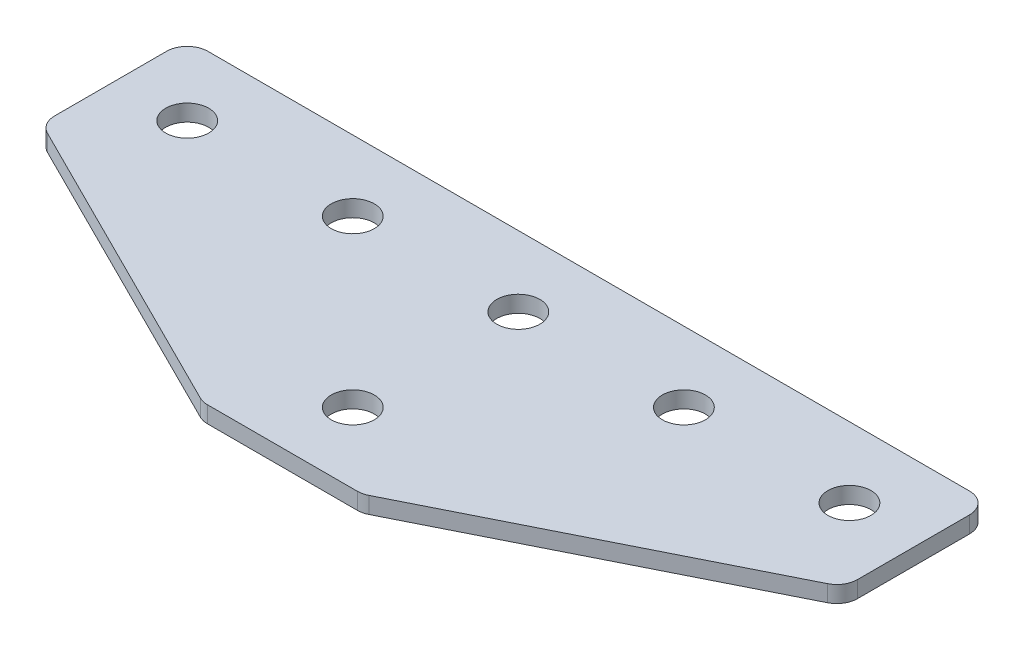
ISO-10303-21;
HEADER;
FILE_DESCRIPTION(('STEP AP214'),'2;1');
FILE_NAME('part.step','',(''),(''),'','','');
FILE_SCHEMA(('AUTOMOTIVE_DESIGN { 1 0 10303 214 1 1 1 1 }'));
ENDSEC;
DATA;
#1=APPLICATION_CONTEXT('core data for automotive mechanical design processes');
#2=APPLICATION_PROTOCOL_DEFINITION('international standard','automotive_design',2000,#1);
#3=PRODUCT_CONTEXT('',#1,'mechanical');
#4=PRODUCT('Part','Part','',(#3));
#5=PRODUCT_RELATED_PRODUCT_CATEGORY('part','',(#4));
#6=PRODUCT_DEFINITION_FORMATION('','',#4);
#7=PRODUCT_DEFINITION_CONTEXT('part definition',#1,'design');
#8=PRODUCT_DEFINITION('design','',#6,#7);
#9=PRODUCT_DEFINITION_SHAPE('','',#8);
#10=(LENGTH_UNIT() NAMED_UNIT(*) SI_UNIT(.MILLI.,.METRE.));
#11=(NAMED_UNIT(*) PLANE_ANGLE_UNIT() SI_UNIT($,.RADIAN.));
#12=(NAMED_UNIT(*) SI_UNIT($,.STERADIAN.) SOLID_ANGLE_UNIT());
#13=UNCERTAINTY_MEASURE_WITH_UNIT(LENGTH_MEASURE(1.E-05),#10,'distance_accuracy_value','');
#14=(GEOMETRIC_REPRESENTATION_CONTEXT(3) GLOBAL_UNCERTAINTY_ASSIGNED_CONTEXT((#13)) GLOBAL_UNIT_ASSIGNED_CONTEXT((#10,
#11,#12)) REPRESENTATION_CONTEXT('',''));
#15=CARTESIAN_POINT('',(0.,0.,0.));
#16=DIRECTION('',(0.,0.,1.));
#17=DIRECTION('',(1.,0.,0.));
#18=AXIS2_PLACEMENT_3D('',#15,#16,#17);
#19=CARTESIAN_POINT('',(-1.40320898344726,2.35790424423976,-11.9541495515227));
#20=DIRECTION('',(0.,-1.,0.));
#21=DIRECTION('',(0.,0.,-1.));
#22=AXIS2_PLACEMENT_3D('',#19,#20,#21);
#23=PLANE('',#22);
#24=CARTESIAN_POINT('',(-1.40320898344726,2.35790424423976,-11.9541495515227));
#25=DIRECTION('',(0.,1.,0.));
#26=DIRECTION('',(0.,0.,1.));
#27=AXIS2_PLACEMENT_3D('',#24,#25,#26);
#28=CIRCLE('',#27,2.6);
#29=CARTESIAN_POINT('',(-1.40320898344726,2.35790424423976,-9.3541495515227));
#30=VERTEX_POINT('',#29);
#31=EDGE_CURVE('E159',#30,#30,#28,.T.);
#32=ORIENTED_EDGE('',*,*,#31,.T.);
#33=EDGE_LOOP('',(#32));
#34=FACE_BOUND('',#33,.T.);
#35=DIRECTION('',(1.,0.,0.));
#36=VECTOR('',#35,1.);
#37=CARTESIAN_POINT('',(-9.90320898344732,2.35790424423976,16.5458504484773));
#38=LINE('',#37,#36);
#39=CARTESIAN_POINT('',(-10.4589370734482,2.35790424423976,16.5458504484773));
#40=VERTEX_POINT('',#39);
#41=CARTESIAN_POINT('',(7.65251910655364,2.35790424423976,16.5458504484773));
#42=VERTEX_POINT('',#41);
#43=EDGE_CURVE('E168',#40,#42,#38,.T.);
#44=ORIENTED_EDGE('',*,*,#43,.F.);
#45=CARTESIAN_POINT('',(-10.4589370734482,2.35790424423976,14.0458504484773));
#46=DIRECTION('',(0.,-1.,0.));
#47=DIRECTION('',(0.,0.,-1.));
#48=AXIS2_PLACEMENT_3D('',#45,#46,#47);
#49=CIRCLE('',#48,2.5);
#50=CARTESIAN_POINT('',(-11.5769710621981,2.35790424423976,16.2819184259771));
#51=VERTEX_POINT('',#50);
#52=EDGE_CURVE('E212',#40,#51,#49,.T.);
#53=ORIENTED_EDGE('',*,*,#52,.T.);
#54=DIRECTION('',(-0.894427190999916,0.,-0.447213595499958));
#55=VECTOR('',#54,1.);
#56=CARTESIAN_POINT('',(-11.0491070171976,2.35790424423976,16.5458504484773));
#57=LINE('',#56,#55);
#58=CARTESIAN_POINT('',(-48.5212429721971,2.35790424423976,-2.19021752902243));
#59=VERTEX_POINT('',#58);
#60=EDGE_CURVE('E132',#51,#59,#57,.T.);
#61=ORIENTED_EDGE('',*,*,#60,.T.);
#62=CARTESIAN_POINT('',(-47.4032089834472,2.35790424423976,-4.42628550652223));
#63=DIRECTION('',(0.,-1.,0.));
#64=DIRECTION('',(0.,0.,-1.));
#65=AXIS2_PLACEMENT_3D('',#62,#63,#64);
#66=CIRCLE('',#65,2.5);
#67=CARTESIAN_POINT('',(-49.9032089834472,2.35790424423976,-4.42628550652223));
#68=VERTEX_POINT('',#67);
#69=EDGE_CURVE('E186',#59,#68,#66,.T.);
#70=ORIENTED_EDGE('',*,*,#69,.T.);
#71=DIRECTION('',(0.,0.,-1.));
#72=VECTOR('',#71,1.);
#73=CARTESIAN_POINT('',(-49.9032089834472,2.35790424423976,-2.88120053464749));
#74=LINE('',#73,#72);
#75=CARTESIAN_POINT('',(-49.9032089834472,2.35790424423976,-17.9541495515227));
#76=VERTEX_POINT('',#75);
#77=EDGE_CURVE('E125',#68,#76,#74,.T.);
#78=ORIENTED_EDGE('',*,*,#77,.T.);
#79=CARTESIAN_POINT('',(-47.4032089834472,2.35790424423976,-17.9541495515227));
#80=DIRECTION('',(0.,-1.,0.));
#81=DIRECTION('',(0.,0.,-1.));
#82=AXIS2_PLACEMENT_3D('',#79,#80,#81);
#83=CIRCLE('',#82,2.5);
#84=CARTESIAN_POINT('',(-47.4032089834472,2.35790424423976,-20.4541495515227));
#85=VERTEX_POINT('',#84);
#86=EDGE_CURVE('E205',#76,#85,#83,.T.);
#87=ORIENTED_EDGE('',*,*,#86,.T.);
#88=DIRECTION('',(-1.,0.,0.));
#89=VECTOR('',#88,1.);
#90=CARTESIAN_POINT('',(47.0967910165527,2.35790424423976,-20.4541495515227));
#91=LINE('',#90,#89);
#92=CARTESIAN_POINT('',(44.5967910165527,2.35790424423976,-20.4541495515227));
#93=VERTEX_POINT('',#92);
#94=EDGE_CURVE('E165',#93,#85,#91,.T.);
#95=ORIENTED_EDGE('',*,*,#94,.F.);
#96=CARTESIAN_POINT('',(44.5967910165527,2.35790424423976,-17.9541495515227));
#97=DIRECTION('',(0.,-1.,0.));
#98=DIRECTION('',(0.,0.,-1.));
#99=AXIS2_PLACEMENT_3D('',#96,#97,#98);
#100=CIRCLE('',#99,2.5);
#101=CARTESIAN_POINT('',(47.0967910165527,2.35790424423976,-17.9541495515227));
#102=VERTEX_POINT('',#101);
#103=EDGE_CURVE('E207',#93,#102,#100,.T.);
#104=ORIENTED_EDGE('',*,*,#103,.T.);
#105=DIRECTION('',(0.,0.,-1.));
#106=VECTOR('',#105,1.);
#107=CARTESIAN_POINT('',(47.0967910165527,2.35790424423976,-2.8812005346475));
#108=LINE('',#107,#106);
#109=CARTESIAN_POINT('',(47.0967910165527,2.35790424423976,-4.42628550652224));
#110=VERTEX_POINT('',#109);
#111=EDGE_CURVE('E126',#110,#102,#108,.T.);
#112=ORIENTED_EDGE('',*,*,#111,.F.);
#113=CARTESIAN_POINT('',(44.5967910165527,2.35790424423976,-4.42628550652224));
#114=DIRECTION('',(0.,-1.,0.));
#115=DIRECTION('',(0.,0.,-1.));
#116=AXIS2_PLACEMENT_3D('',#113,#114,#115);
#117=CIRCLE('',#116,2.5);
#118=CARTESIAN_POINT('',(45.7148250053026,2.35790424423976,-2.19021752902245));
#119=VERTEX_POINT('',#118);
#120=EDGE_CURVE('E31',#110,#119,#117,.T.);
#121=ORIENTED_EDGE('',*,*,#120,.T.);
#122=DIRECTION('',(0.894427190999916,0.,-0.447213595499958));
#123=VECTOR('',#122,1.);
#124=CARTESIAN_POINT('',(8.24268905030312,2.35790424423976,16.5458504484773));
#125=LINE('',#124,#123);
#126=CARTESIAN_POINT('',(8.77055309530354,2.35790424423976,16.2819184259771));
#127=VERTEX_POINT('',#126);
#128=EDGE_CURVE('E172',#127,#119,#125,.T.);
#129=ORIENTED_EDGE('',*,*,#128,.F.);
#130=CARTESIAN_POINT('',(7.65251910655364,2.35790424423976,14.0458504484773));
#131=DIRECTION('',(0.,-1.,0.));
#132=DIRECTION('',(0.,0.,-1.));
#133=AXIS2_PLACEMENT_3D('',#130,#131,#132);
#134=CIRCLE('',#133,2.5);
#135=EDGE_CURVE('E210',#127,#42,#134,.T.);
#136=ORIENTED_EDGE('',*,*,#135,.T.);
#137=EDGE_LOOP('',(#44,#53,#61,#70,#78,#87,#95,#104,#112,#121,#129,#136));
#138=FACE_BOUND('',#137,.T.);
#139=CARTESIAN_POINT('',(-1.40320898344727,2.35790424423976,8.04585044847731));
#140=DIRECTION('',(0.,1.,0.));
#141=DIRECTION('',(0.,0.,1.));
#142=AXIS2_PLACEMENT_3D('',#139,#140,#141);
#143=CIRCLE('',#142,2.6);
#144=CARTESIAN_POINT('',(-1.40320898344727,2.35790424423976,10.6458504484773));
#145=VERTEX_POINT('',#144);
#146=EDGE_CURVE('E147',#145,#145,#143,.T.);
#147=ORIENTED_EDGE('',*,*,#146,.T.);
#148=EDGE_LOOP('',(#147));
#149=FACE_BOUND('',#148,.T.);
#150=CARTESIAN_POINT('',(38.5967910165527,2.35790424423976,-11.9541495515227));
#151=DIRECTION('',(0.,1.,0.));
#152=DIRECTION('',(0.,0.,1.));
#153=AXIS2_PLACEMENT_3D('',#150,#151,#152);
#154=CIRCLE('',#153,2.6);
#155=CARTESIAN_POINT('',(38.5967910165527,2.35790424423976,-9.3541495515227));
#156=VERTEX_POINT('',#155);
#157=EDGE_CURVE('E140',#156,#156,#154,.T.);
#158=ORIENTED_EDGE('',*,*,#157,.T.);
#159=EDGE_LOOP('',(#158));
#160=FACE_BOUND('',#159,.T.);
#161=CARTESIAN_POINT('',(18.5967910165527,2.35790424423976,-11.9541495515227));
#162=DIRECTION('',(0.,1.,0.));
#163=DIRECTION('',(0.,0.,1.));
#164=AXIS2_PLACEMENT_3D('',#161,#162,#163);
#165=CIRCLE('',#164,2.6);
#166=CARTESIAN_POINT('',(18.5967910165527,2.35790424423976,-9.35414955152269));
#167=VERTEX_POINT('',#166);
#168=EDGE_CURVE('E153',#167,#167,#165,.T.);
#169=ORIENTED_EDGE('',*,*,#168,.T.);
#170=EDGE_LOOP('',(#169));
#171=FACE_BOUND('',#170,.T.);
#172=CARTESIAN_POINT('',(-41.4032089834473,2.35790424423976,-11.9541495515227));
#173=DIRECTION('',(0.,-1.,0.));
#174=DIRECTION('',(0.,0.,1.));
#175=AXIS2_PLACEMENT_3D('',#172,#173,#174);
#176=CIRCLE('',#175,2.6);
#177=CARTESIAN_POINT('',(-41.4032089834473,2.35790424423976,-9.35414955152269));
#178=VERTEX_POINT('',#177);
#179=EDGE_CURVE('E460',#178,#178,#176,.T.);
#180=ORIENTED_EDGE('',*,*,#179,.F.);
#181=EDGE_LOOP('',(#180));
#182=FACE_BOUND('',#181,.T.);
#183=CARTESIAN_POINT('',(-21.4032089834473,2.35790424423976,-11.9541495515227));
#184=DIRECTION('',(0.,-1.,0.));
#185=DIRECTION('',(0.,0.,1.));
#186=AXIS2_PLACEMENT_3D('',#183,#184,#185);
#187=CIRCLE('',#186,2.6);
#188=CARTESIAN_POINT('',(-21.4032089834473,2.35790424423976,-9.35414955152268));
#189=VERTEX_POINT('',#188);
#190=EDGE_CURVE('E136',#189,#189,#187,.T.);
#191=ORIENTED_EDGE('',*,*,#190,.F.);
#192=EDGE_LOOP('',(#191));
#193=FACE_BOUND('',#192,.T.);
#194=ADVANCED_FACE('F16',(#34,#138,#149,#160,#171,#182,#193),#23,.T.);
#195=CARTESIAN_POINT('',(47.0967910165527,2.35790424423976,-20.4541495515227));
#196=DIRECTION('',(0.,0.,-1.));
#197=DIRECTION('',(-1.,0.,0.));
#198=AXIS2_PLACEMENT_3D('',#195,#196,#197);
#199=PLANE('',#198);
#200=DIRECTION('',(-1.,0.,0.));
#201=VECTOR('',#200,1.);
#202=CARTESIAN_POINT('',(47.0967910165527,4.35790424423976,-20.4541495515227));
#203=LINE('',#202,#201);
#204=CARTESIAN_POINT('',(44.5967910165527,4.35790424423976,-20.4541495515227));
#205=VERTEX_POINT('',#204);
#206=CARTESIAN_POINT('',(-47.4032089834472,4.35790424423976,-20.4541495515227));
#207=VERTEX_POINT('',#206);
#208=EDGE_CURVE('E162',#205,#207,#203,.T.);
#209=ORIENTED_EDGE('',*,*,#208,.F.);
#210=DIRECTION('',(0.,1.,0.));
#211=VECTOR('',#210,1.);
#212=CARTESIAN_POINT('',(44.5967910165527,2.35790424423976,-20.4541495515227));
#213=LINE('',#212,#211);
#214=EDGE_CURVE('E24',#205,#93,#213,.F.);
#215=ORIENTED_EDGE('',*,*,#214,.T.);
#216=ORIENTED_EDGE('',*,*,#94,.T.);
#217=DIRECTION('',(0.,1.,0.));
#218=VECTOR('',#217,1.);
#219=CARTESIAN_POINT('',(-47.4032089834472,2.35790424423976,-20.4541495515227));
#220=LINE('',#219,#218);
#221=EDGE_CURVE('E223',#85,#207,#220,.T.);
#222=ORIENTED_EDGE('',*,*,#221,.T.);
#223=EDGE_LOOP('',(#209,#215,#216,#222));
#224=FACE_BOUND('',#223,.T.);
#225=ADVANCED_FACE('F229',(#224),#199,.T.);
#226=CARTESIAN_POINT('',(47.0967910165527,2.35790424423976,-2.8812005346475));
#227=DIRECTION('',(1.,0.,0.));
#228=DIRECTION('',(0.,0.,-1.));
#229=AXIS2_PLACEMENT_3D('',#226,#227,#228);
#230=PLANE('',#229);
#231=DIRECTION('',(0.,0.,-1.));
#232=VECTOR('',#231,1.);
#233=CARTESIAN_POINT('',(47.0967910165527,4.35790424423976,-2.8812005346475));
#234=LINE('',#233,#232);
#235=CARTESIAN_POINT('',(47.0967910165527,4.35790424423976,-4.42628550652224));
#236=VERTEX_POINT('',#235);
#237=CARTESIAN_POINT('',(47.0967910165527,4.35790424423976,-17.9541495515227));
#238=VERTEX_POINT('',#237);
#239=EDGE_CURVE('E169',#236,#238,#234,.T.);
#240=ORIENTED_EDGE('',*,*,#239,.F.);
#241=DIRECTION('',(0.,1.,0.));
#242=VECTOR('',#241,1.);
#243=CARTESIAN_POINT('',(47.0967910165527,2.35790424423976,-4.42628550652224));
#244=LINE('',#243,#242);
#245=EDGE_CURVE('E221',#236,#110,#244,.F.);
#246=ORIENTED_EDGE('',*,*,#245,.T.);
#247=ORIENTED_EDGE('',*,*,#111,.T.);
#248=DIRECTION('',(0.,1.,0.));
#249=VECTOR('',#248,1.);
#250=CARTESIAN_POINT('',(47.0967910165527,2.35790424423976,-17.9541495515227));
#251=LINE('',#250,#249);
#252=EDGE_CURVE('E218',#102,#238,#251,.T.);
#253=ORIENTED_EDGE('',*,*,#252,.T.);
#254=EDGE_LOOP('',(#240,#246,#247,#253));
#255=FACE_BOUND('',#254,.T.);
#256=ADVANCED_FACE('F240',(#255),#230,.T.);
#257=CARTESIAN_POINT('',(8.24268905030312,2.35790424423976,16.5458504484773));
#258=DIRECTION('',(0.447213595499958,0.,0.894427190999916));
#259=DIRECTION('',(0.894427190999916,0.,-0.447213595499958));
#260=AXIS2_PLACEMENT_3D('',#257,#258,#259);
#261=PLANE('',#260);
#262=DIRECTION('',(0.894427190999916,0.,-0.447213595499958));
#263=VECTOR('',#262,1.);
#264=CARTESIAN_POINT('',(8.24268905030312,4.35790424423976,16.5458504484773));
#265=LINE('',#264,#263);
#266=CARTESIAN_POINT('',(8.77055309530354,4.35790424423976,16.2819184259771));
#267=VERTEX_POINT('',#266);
#268=CARTESIAN_POINT('',(45.7148250053026,4.35790424423976,-2.19021752902245));
#269=VERTEX_POINT('',#268);
#270=EDGE_CURVE('E180',#267,#269,#265,.T.);
#271=ORIENTED_EDGE('',*,*,#270,.F.);
#272=DIRECTION('',(0.,1.,0.));
#273=VECTOR('',#272,1.);
#274=CARTESIAN_POINT('',(8.77055309530354,2.35790424423976,16.2819184259771));
#275=LINE('',#274,#273);
#276=EDGE_CURVE('E38',#267,#127,#275,.F.);
#277=ORIENTED_EDGE('',*,*,#276,.T.);
#278=ORIENTED_EDGE('',*,*,#128,.T.);
#279=DIRECTION('',(0.,1.,0.));
#280=VECTOR('',#279,1.);
#281=CARTESIAN_POINT('',(45.7148250053026,2.35790424423976,-2.19021752902245));
#282=LINE('',#281,#280);
#283=EDGE_CURVE('E214',#119,#269,#282,.T.);
#284=ORIENTED_EDGE('',*,*,#283,.T.);
#285=EDGE_LOOP('',(#271,#277,#278,#284));
#286=FACE_BOUND('',#285,.T.);
#287=ADVANCED_FACE('F245',(#286),#261,.T.);
#288=CARTESIAN_POINT('',(-9.90320898344732,2.35790424423976,16.5458504484773));
#289=DIRECTION('',(0.,0.,1.));
#290=DIRECTION('',(1.,0.,0.));
#291=AXIS2_PLACEMENT_3D('',#288,#289,#290);
#292=PLANE('',#291);
#293=DIRECTION('',(1.,0.,0.));
#294=VECTOR('',#293,1.);
#295=CARTESIAN_POINT('',(-9.90320898344732,4.35790424423976,16.5458504484773));
#296=LINE('',#295,#294);
#297=CARTESIAN_POINT('',(-10.4589370734482,4.35790424423976,16.5458504484773));
#298=VERTEX_POINT('',#297);
#299=CARTESIAN_POINT('',(7.65251910655364,4.35790424423976,16.5458504484773));
#300=VERTEX_POINT('',#299);
#301=EDGE_CURVE('E177',#298,#300,#296,.T.);
#302=ORIENTED_EDGE('',*,*,#301,.F.);
#303=DIRECTION('',(0.,1.,0.));
#304=VECTOR('',#303,1.);
#305=CARTESIAN_POINT('',(-10.4589370734482,2.35790424423976,16.5458504484773));
#306=LINE('',#305,#304);
#307=EDGE_CURVE('E203',#298,#40,#306,.F.);
#308=ORIENTED_EDGE('',*,*,#307,.T.);
#309=ORIENTED_EDGE('',*,*,#43,.T.);
#310=DIRECTION('',(0.,1.,0.));
#311=VECTOR('',#310,1.);
#312=CARTESIAN_POINT('',(7.65251910655364,2.35790424423976,16.5458504484773));
#313=LINE('',#312,#311);
#314=EDGE_CURVE('E200',#42,#300,#313,.T.);
#315=ORIENTED_EDGE('',*,*,#314,.T.);
#316=EDGE_LOOP('',(#302,#308,#309,#315));
#317=FACE_BOUND('',#316,.T.);
#318=ADVANCED_FACE('F252',(#317),#292,.T.);
#319=CARTESIAN_POINT('',(-1.40320898344726,4.35790424423976,-11.9541495515227));
#320=DIRECTION('',(0.,-1.,0.));
#321=DIRECTION('',(0.,0.,-1.));
#322=AXIS2_PLACEMENT_3D('',#319,#320,#321);
#323=PLANE('',#322);
#324=CARTESIAN_POINT('',(-1.40320898344726,4.35790424423976,-11.9541495515227));
#325=DIRECTION('',(0.,1.,0.));
#326=DIRECTION('',(0.,0.,1.));
#327=AXIS2_PLACEMENT_3D('',#324,#325,#326);
#328=CIRCLE('',#327,2.6);
#329=CARTESIAN_POINT('',(-1.40320898344726,4.35790424423976,-9.3541495515227));
#330=VERTEX_POINT('',#329);
#331=EDGE_CURVE('E156',#330,#330,#328,.T.);
#332=ORIENTED_EDGE('',*,*,#331,.F.);
#333=EDGE_LOOP('',(#332));
#334=FACE_BOUND('',#333,.T.);
#335=DIRECTION('',(-0.894427190999916,0.,-0.447213595499958));
#336=VECTOR('',#335,1.);
#337=CARTESIAN_POINT('',(-11.0491070171976,4.35790424423976,16.5458504484773));
#338=LINE('',#337,#336);
#339=CARTESIAN_POINT('',(-11.5769710621981,4.35790424423976,16.2819184259771));
#340=VERTEX_POINT('',#339);
#341=CARTESIAN_POINT('',(-48.5212429721971,4.35790424423976,-2.19021752902243));
#342=VERTEX_POINT('',#341);
#343=EDGE_CURVE('E133',#340,#342,#338,.T.);
#344=ORIENTED_EDGE('',*,*,#343,.F.);
#345=CARTESIAN_POINT('',(-10.4589370734482,4.35790424423976,14.0458504484773));
#346=DIRECTION('',(0.,-1.,0.));
#347=DIRECTION('',(0.,0.,-1.));
#348=AXIS2_PLACEMENT_3D('',#345,#346,#347);
#349=CIRCLE('',#348,2.5);
#350=EDGE_CURVE('E198',#340,#298,#349,.F.);
#351=ORIENTED_EDGE('',*,*,#350,.T.);
#352=ORIENTED_EDGE('',*,*,#301,.T.);
#353=CARTESIAN_POINT('',(7.65251910655364,4.35790424423976,14.0458504484773));
#354=DIRECTION('',(0.,-1.,0.));
#355=DIRECTION('',(0.,0.,-1.));
#356=AXIS2_PLACEMENT_3D('',#353,#354,#355);
#357=CIRCLE('',#356,2.5);
#358=EDGE_CURVE('E196',#300,#267,#357,.F.);
#359=ORIENTED_EDGE('',*,*,#358,.T.);
#360=ORIENTED_EDGE('',*,*,#270,.T.);
#361=CARTESIAN_POINT('',(44.5967910165527,4.35790424423976,-4.42628550652224));
#362=DIRECTION('',(0.,-1.,0.));
#363=DIRECTION('',(0.,0.,-1.));
#364=AXIS2_PLACEMENT_3D('',#361,#362,#363);
#365=CIRCLE('',#364,2.5);
#366=EDGE_CURVE('E194',#269,#236,#365,.F.);
#367=ORIENTED_EDGE('',*,*,#366,.T.);
#368=ORIENTED_EDGE('',*,*,#239,.T.);
#369=CARTESIAN_POINT('',(44.5967910165527,4.35790424423976,-17.9541495515227));
#370=DIRECTION('',(0.,-1.,0.));
#371=DIRECTION('',(0.,0.,-1.));
#372=AXIS2_PLACEMENT_3D('',#369,#370,#371);
#373=CIRCLE('',#372,2.5);
#374=EDGE_CURVE('E192',#238,#205,#373,.F.);
#375=ORIENTED_EDGE('',*,*,#374,.T.);
#376=ORIENTED_EDGE('',*,*,#208,.T.);
#377=CARTESIAN_POINT('',(-47.4032089834472,4.35790424423976,-17.9541495515227));
#378=DIRECTION('',(0.,-1.,0.));
#379=DIRECTION('',(0.,0.,-1.));
#380=AXIS2_PLACEMENT_3D('',#377,#378,#379);
#381=CIRCLE('',#380,2.5);
#382=CARTESIAN_POINT('',(-49.9032089834472,4.35790424423976,-17.9541495515227));
#383=VERTEX_POINT('',#382);
#384=EDGE_CURVE('E131',#207,#383,#381,.F.);
#385=ORIENTED_EDGE('',*,*,#384,.T.);
#386=DIRECTION('',(0.,0.,-1.));
#387=VECTOR('',#386,1.);
#388=CARTESIAN_POINT('',(-49.9032089834472,4.35790424423976,-2.88120053464749));
#389=LINE('',#388,#387);
#390=CARTESIAN_POINT('',(-49.9032089834472,4.35790424423976,-4.42628550652223));
#391=VERTEX_POINT('',#390);
#392=EDGE_CURVE('E122',#391,#383,#389,.T.);
#393=ORIENTED_EDGE('',*,*,#392,.F.);
#394=CARTESIAN_POINT('',(-47.4032089834472,4.35790424423976,-4.42628550652223));
#395=DIRECTION('',(0.,-1.,0.));
#396=DIRECTION('',(0.,0.,-1.));
#397=AXIS2_PLACEMENT_3D('',#394,#395,#396);
#398=CIRCLE('',#397,2.5);
#399=EDGE_CURVE('E107',#391,#342,#398,.F.);
#400=ORIENTED_EDGE('',*,*,#399,.T.);
#401=EDGE_LOOP('',(#344,#351,#352,#359,#360,#367,#368,#375,#376,#385,#393,#400));
#402=FACE_BOUND('',#401,.T.);
#403=CARTESIAN_POINT('',(38.5967910165527,4.35790424423976,-11.9541495515227));
#404=DIRECTION('',(0.,1.,0.));
#405=DIRECTION('',(0.,0.,1.));
#406=AXIS2_PLACEMENT_3D('',#403,#404,#405);
#407=CIRCLE('',#406,2.6);
#408=CARTESIAN_POINT('',(38.5967910165527,4.35790424423976,-9.3541495515227));
#409=VERTEX_POINT('',#408);
#410=EDGE_CURVE('E144',#409,#409,#407,.T.);
#411=ORIENTED_EDGE('',*,*,#410,.F.);
#412=EDGE_LOOP('',(#411));
#413=FACE_BOUND('',#412,.T.);
#414=CARTESIAN_POINT('',(18.5967910165527,4.35790424423976,-11.9541495515227));
#415=DIRECTION('',(0.,1.,0.));
#416=DIRECTION('',(0.,0.,1.));
#417=AXIS2_PLACEMENT_3D('',#414,#415,#416);
#418=CIRCLE('',#417,2.6);
#419=CARTESIAN_POINT('',(18.5967910165527,4.35790424423976,-9.35414955152269));
#420=VERTEX_POINT('',#419);
#421=EDGE_CURVE('E150',#420,#420,#418,.T.);
#422=ORIENTED_EDGE('',*,*,#421,.F.);
#423=EDGE_LOOP('',(#422));
#424=FACE_BOUND('',#423,.T.);
#425=CARTESIAN_POINT('',(-1.40320898344727,4.35790424423976,8.04585044847731));
#426=DIRECTION('',(0.,1.,0.));
#427=DIRECTION('',(0.,0.,1.));
#428=AXIS2_PLACEMENT_3D('',#425,#426,#427);
#429=CIRCLE('',#428,2.6);
#430=CARTESIAN_POINT('',(-1.40320898344727,4.35790424423976,10.6458504484773));
#431=VERTEX_POINT('',#430);
#432=EDGE_CURVE('E143',#431,#431,#429,.T.);
#433=ORIENTED_EDGE('',*,*,#432,.F.);
#434=EDGE_LOOP('',(#433));
#435=FACE_BOUND('',#434,.T.);
#436=CARTESIAN_POINT('',(-41.4032089834473,4.35790424423976,-11.9541495515227));
#437=DIRECTION('',(0.,-1.,0.));
#438=DIRECTION('',(0.,0.,1.));
#439=AXIS2_PLACEMENT_3D('',#436,#437,#438);
#440=CIRCLE('',#439,2.6);
#441=CARTESIAN_POINT('',(-41.4032089834473,4.35790424423976,-9.35414955152269));
#442=VERTEX_POINT('',#441);
#443=EDGE_CURVE('E455',#442,#442,#440,.T.);
#444=ORIENTED_EDGE('',*,*,#443,.T.);
#445=EDGE_LOOP('',(#444));
#446=FACE_BOUND('',#445,.T.);
#447=CARTESIAN_POINT('',(-21.4032089834473,4.35790424423976,-11.9541495515227));
#448=DIRECTION('',(0.,-1.,0.));
#449=DIRECTION('',(0.,0.,1.));
#450=AXIS2_PLACEMENT_3D('',#447,#448,#449);
#451=CIRCLE('',#450,2.6);
#452=CARTESIAN_POINT('',(-21.4032089834473,4.35790424423976,-9.35414955152268));
#453=VERTEX_POINT('',#452);
#454=EDGE_CURVE('E458',#453,#453,#451,.T.);
#455=ORIENTED_EDGE('',*,*,#454,.T.);
#456=EDGE_LOOP('',(#455));
#457=FACE_BOUND('',#456,.T.);
#458=ADVANCED_FACE('F128',(#334,#402,#413,#424,#435,#446,#457),#323,.F.);
#459=CARTESIAN_POINT('',(-1.40320898344726,2.35790424423976,-11.9541495515227));
#460=DIRECTION('',(0.,1.,0.));
#461=DIRECTION('',(0.,0.,1.));
#462=AXIS2_PLACEMENT_3D('',#459,#460,#461);
#463=CYLINDRICAL_SURFACE('',#462,2.6);
#464=ORIENTED_EDGE('',*,*,#31,.F.);
#465=EDGE_LOOP('',(#464));
#466=FACE_BOUND('',#465,.T.);
#467=ORIENTED_EDGE('',*,*,#331,.T.);
#468=EDGE_LOOP('',(#467));
#469=FACE_BOUND('',#468,.T.);
#470=ADVANCED_FACE('F379',(#466,#469),#463,.F.);
#471=CARTESIAN_POINT('',(18.5967910165527,2.35790424423976,-11.9541495515227));
#472=DIRECTION('',(0.,1.,0.));
#473=DIRECTION('',(0.,0.,1.));
#474=AXIS2_PLACEMENT_3D('',#471,#472,#473);
#475=CYLINDRICAL_SURFACE('',#474,2.6);
#476=ORIENTED_EDGE('',*,*,#168,.F.);
#477=EDGE_LOOP('',(#476));
#478=FACE_BOUND('',#477,.T.);
#479=ORIENTED_EDGE('',*,*,#421,.T.);
#480=EDGE_LOOP('',(#479));
#481=FACE_BOUND('',#480,.T.);
#482=ADVANCED_FACE('F370',(#478,#481),#475,.F.);
#483=CARTESIAN_POINT('',(-1.40320898344727,2.35790424423976,8.04585044847731));
#484=DIRECTION('',(0.,1.,0.));
#485=DIRECTION('',(0.,0.,1.));
#486=AXIS2_PLACEMENT_3D('',#483,#484,#485);
#487=CYLINDRICAL_SURFACE('',#486,2.6);
#488=ORIENTED_EDGE('',*,*,#432,.T.);
#489=EDGE_LOOP('',(#488));
#490=FACE_BOUND('',#489,.T.);
#491=ORIENTED_EDGE('',*,*,#146,.F.);
#492=EDGE_LOOP('',(#491));
#493=FACE_BOUND('',#492,.T.);
#494=ADVANCED_FACE('F361',(#490,#493),#487,.F.);
#495=CARTESIAN_POINT('',(38.5967910165527,2.35790424423976,-11.9541495515227));
#496=DIRECTION('',(0.,1.,0.));
#497=DIRECTION('',(0.,0.,1.));
#498=AXIS2_PLACEMENT_3D('',#495,#496,#497);
#499=CYLINDRICAL_SURFACE('',#498,2.6);
#500=ORIENTED_EDGE('',*,*,#157,.F.);
#501=EDGE_LOOP('',(#500));
#502=FACE_BOUND('',#501,.T.);
#503=ORIENTED_EDGE('',*,*,#410,.T.);
#504=EDGE_LOOP('',(#503));
#505=FACE_BOUND('',#504,.T.);
#506=ADVANCED_FACE('F353',(#502,#505),#499,.F.);
#507=CARTESIAN_POINT('',(-49.9032089834472,2.35790424423976,-2.88120053464749));
#508=DIRECTION('',(-1.,0.,0.));
#509=DIRECTION('',(0.,0.,-1.));
#510=AXIS2_PLACEMENT_3D('',#507,#508,#509);
#511=PLANE('',#510);
#512=ORIENTED_EDGE('',*,*,#392,.T.);
#513=DIRECTION('',(0.,1.,0.));
#514=VECTOR('',#513,1.);
#515=CARTESIAN_POINT('',(-49.9032089834472,2.35790424423976,-17.9541495515227));
#516=LINE('',#515,#514);
#517=EDGE_CURVE('E10',#383,#76,#516,.F.);
#518=ORIENTED_EDGE('',*,*,#517,.T.);
#519=ORIENTED_EDGE('',*,*,#77,.F.);
#520=DIRECTION('',(0.,1.,0.));
#521=VECTOR('',#520,1.);
#522=CARTESIAN_POINT('',(-49.9032089834472,2.35790424423976,-4.42628550652223));
#523=LINE('',#522,#521);
#524=EDGE_CURVE('E111',#68,#391,#523,.T.);
#525=ORIENTED_EDGE('',*,*,#524,.T.);
#526=EDGE_LOOP('',(#512,#518,#519,#525));
#527=FACE_BOUND('',#526,.T.);
#528=ADVANCED_FACE('F121',(#527),#511,.T.);
#529=CARTESIAN_POINT('',(-11.0491070171976,2.35790424423976,16.5458504484773));
#530=DIRECTION('',(-0.447213595499958,0.,0.894427190999916));
#531=DIRECTION('',(-0.894427190999916,0.,-0.447213595499958));
#532=AXIS2_PLACEMENT_3D('',#529,#530,#531);
#533=PLANE('',#532);
#534=ORIENTED_EDGE('',*,*,#60,.F.);
#535=DIRECTION('',(0.,1.,0.));
#536=VECTOR('',#535,1.);
#537=CARTESIAN_POINT('',(-11.5769710621981,2.35790424423976,16.2819184259771));
#538=LINE('',#537,#536);
#539=EDGE_CURVE('E188',#51,#340,#538,.T.);
#540=ORIENTED_EDGE('',*,*,#539,.T.);
#541=ORIENTED_EDGE('',*,*,#343,.T.);
#542=DIRECTION('',(0.,1.,0.));
#543=VECTOR('',#542,1.);
#544=CARTESIAN_POINT('',(-48.5212429721971,2.35790424423976,-2.19021752902243));
#545=LINE('',#544,#543);
#546=EDGE_CURVE('E113',#342,#59,#545,.F.);
#547=ORIENTED_EDGE('',*,*,#546,.T.);
#548=EDGE_LOOP('',(#534,#540,#541,#547));
#549=FACE_BOUND('',#548,.T.);
#550=ADVANCED_FACE('F260',(#549),#533,.T.);
#551=CARTESIAN_POINT('',(-21.4032089834473,2.35790424423976,-11.9541495515227));
#552=DIRECTION('',(0.,1.,0.));
#553=DIRECTION('',(0.,0.,1.));
#554=AXIS2_PLACEMENT_3D('',#551,#552,#553);
#555=CYLINDRICAL_SURFACE('',#554,2.6);
#556=ORIENTED_EDGE('',*,*,#190,.T.);
#557=EDGE_LOOP('',(#556));
#558=FACE_BOUND('',#557,.T.);
#559=ORIENTED_EDGE('',*,*,#454,.F.);
#560=EDGE_LOOP('',(#559));
#561=FACE_BOUND('',#560,.T.);
#562=ADVANCED_FACE('F329',(#558,#561),#555,.F.);
#563=CARTESIAN_POINT('',(-41.4032089834473,2.35790424423976,-11.9541495515227));
#564=DIRECTION('',(0.,1.,0.));
#565=DIRECTION('',(0.,0.,1.));
#566=AXIS2_PLACEMENT_3D('',#563,#564,#565);
#567=CYLINDRICAL_SURFACE('',#566,2.6);
#568=ORIENTED_EDGE('',*,*,#179,.T.);
#569=EDGE_LOOP('',(#568));
#570=FACE_BOUND('',#569,.T.);
#571=ORIENTED_EDGE('',*,*,#443,.F.);
#572=EDGE_LOOP('',(#571));
#573=FACE_BOUND('',#572,.T.);
#574=ADVANCED_FACE('F278',(#570,#573),#567,.F.);
#575=CARTESIAN_POINT('',(-47.4032089834472,2.35790424423976,-4.42628550652223));
#576=DIRECTION('',(0.,1.,0.));
#577=DIRECTION('',(0.,0.,1.));
#578=AXIS2_PLACEMENT_3D('',#575,#576,#577);
#579=CYLINDRICAL_SURFACE('',#578,2.5);
#580=ORIENTED_EDGE('',*,*,#69,.F.);
#581=ORIENTED_EDGE('',*,*,#546,.F.);
#582=ORIENTED_EDGE('',*,*,#399,.F.);
#583=ORIENTED_EDGE('',*,*,#524,.F.);
#584=EDGE_LOOP('',(#580,#581,#582,#583));
#585=FACE_BOUND('',#584,.T.);
#586=ADVANCED_FACE('F110',(#585),#579,.T.);
#587=CARTESIAN_POINT('',(-10.4589370734482,2.35790424423976,14.0458504484773));
#588=DIRECTION('',(0.,1.,0.));
#589=DIRECTION('',(0.,0.,1.));
#590=AXIS2_PLACEMENT_3D('',#587,#588,#589);
#591=CYLINDRICAL_SURFACE('',#590,2.5);
#592=ORIENTED_EDGE('',*,*,#52,.F.);
#593=ORIENTED_EDGE('',*,*,#307,.F.);
#594=ORIENTED_EDGE('',*,*,#350,.F.);
#595=ORIENTED_EDGE('',*,*,#539,.F.);
#596=EDGE_LOOP('',(#592,#593,#594,#595));
#597=FACE_BOUND('',#596,.T.);
#598=ADVANCED_FACE('F257',(#597),#591,.T.);
#599=CARTESIAN_POINT('',(7.65251910655364,2.35790424423976,14.0458504484773));
#600=DIRECTION('',(0.,1.,0.));
#601=DIRECTION('',(0.,0.,1.));
#602=AXIS2_PLACEMENT_3D('',#599,#600,#601);
#603=CYLINDRICAL_SURFACE('',#602,2.5);
#604=ORIENTED_EDGE('',*,*,#135,.F.);
#605=ORIENTED_EDGE('',*,*,#276,.F.);
#606=ORIENTED_EDGE('',*,*,#358,.F.);
#607=ORIENTED_EDGE('',*,*,#314,.F.);
#608=EDGE_LOOP('',(#604,#605,#606,#607));
#609=FACE_BOUND('',#608,.T.);
#610=ADVANCED_FACE('F249',(#609),#603,.T.);
#611=CARTESIAN_POINT('',(44.5967910165527,2.35790424423976,-4.42628550652224));
#612=DIRECTION('',(0.,1.,0.));
#613=DIRECTION('',(0.,0.,1.));
#614=AXIS2_PLACEMENT_3D('',#611,#612,#613);
#615=CYLINDRICAL_SURFACE('',#614,2.5);
#616=ORIENTED_EDGE('',*,*,#120,.F.);
#617=ORIENTED_EDGE('',*,*,#245,.F.);
#618=ORIENTED_EDGE('',*,*,#366,.F.);
#619=ORIENTED_EDGE('',*,*,#283,.F.);
#620=EDGE_LOOP('',(#616,#617,#618,#619));
#621=FACE_BOUND('',#620,.T.);
#622=ADVANCED_FACE('F244',(#621),#615,.T.);
#623=CARTESIAN_POINT('',(44.5967910165527,2.35790424423976,-17.9541495515227));
#624=DIRECTION('',(0.,1.,0.));
#625=DIRECTION('',(0.,0.,1.));
#626=AXIS2_PLACEMENT_3D('',#623,#624,#625);
#627=CYLINDRICAL_SURFACE('',#626,2.5);
#628=ORIENTED_EDGE('',*,*,#103,.F.);
#629=ORIENTED_EDGE('',*,*,#214,.F.);
#630=ORIENTED_EDGE('',*,*,#374,.F.);
#631=ORIENTED_EDGE('',*,*,#252,.F.);
#632=EDGE_LOOP('',(#628,#629,#630,#631));
#633=FACE_BOUND('',#632,.T.);
#634=ADVANCED_FACE('F237',(#633),#627,.T.);
#635=CARTESIAN_POINT('',(-47.4032089834472,2.35790424423976,-17.9541495515227));
#636=DIRECTION('',(0.,1.,0.));
#637=DIRECTION('',(0.,0.,1.));
#638=AXIS2_PLACEMENT_3D('',#635,#636,#637);
#639=CYLINDRICAL_SURFACE('',#638,2.5);
#640=ORIENTED_EDGE('',*,*,#86,.F.);
#641=ORIENTED_EDGE('',*,*,#517,.F.);
#642=ORIENTED_EDGE('',*,*,#384,.F.);
#643=ORIENTED_EDGE('',*,*,#221,.F.);
#644=EDGE_LOOP('',(#640,#641,#642,#643));
#645=FACE_BOUND('',#644,.T.);
#646=ADVANCED_FACE('F18',(#645),#639,.T.);
#647=CLOSED_SHELL('',(#194,#225,#256,#287,#318,#458,#470,#482,#494,#506,#528,#550,#562,#574,
#586,#598,#610,#622,#634,#646));
#648=MANIFOLD_SOLID_BREP('B1',#647);
#649=ADVANCED_BREP_SHAPE_REPRESENTATION('',(#18,#648),#14);
#650=SHAPE_DEFINITION_REPRESENTATION(#9,#649);
ENDSEC;
END-ISO-10303-21;
